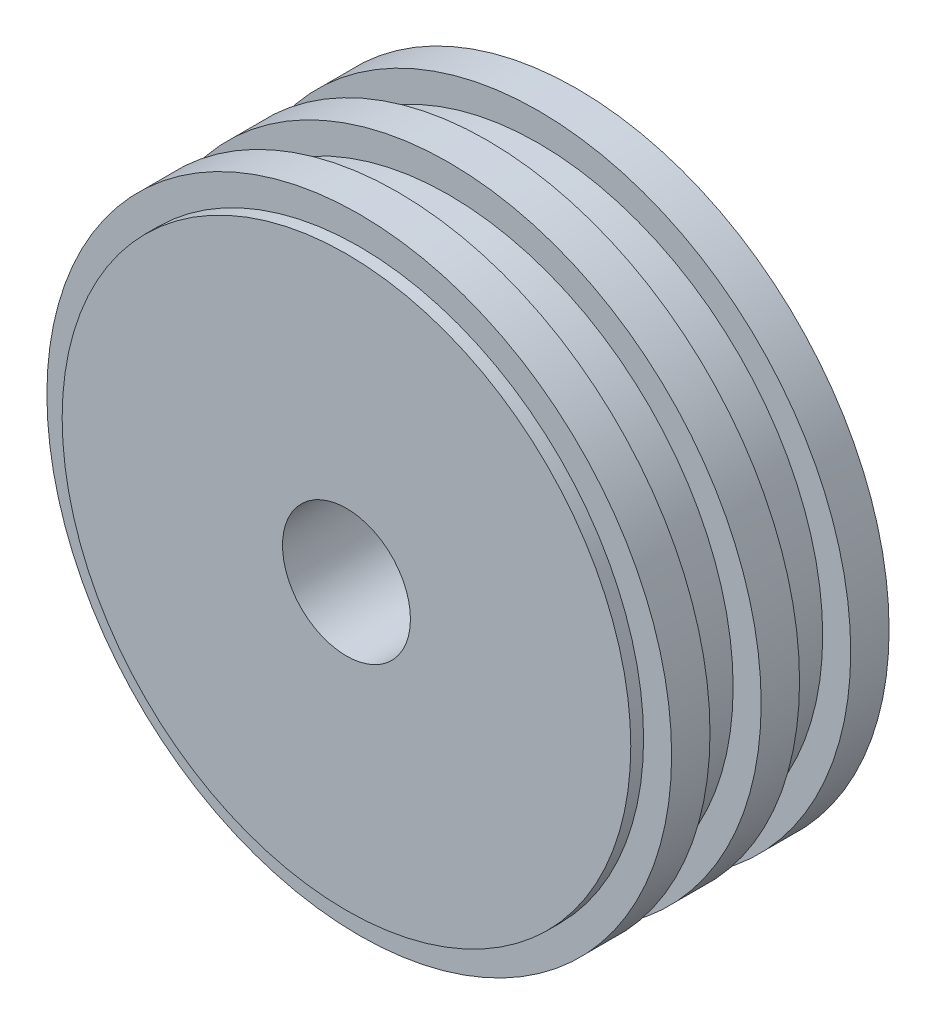
ISO-10303-21;
HEADER;
FILE_DESCRIPTION(('STEP AP214'),'2;1');
FILE_NAME('part.step','',(''),(''),'','','');
FILE_SCHEMA(('AUTOMOTIVE_DESIGN { 1 0 10303 214 1 1 1 1 }'));
ENDSEC;
DATA;
#1=APPLICATION_CONTEXT('core data for automotive mechanical design processes');
#2=APPLICATION_PROTOCOL_DEFINITION('international standard','automotive_design',2000,#1);
#3=PRODUCT_CONTEXT('',#1,'mechanical');
#4=PRODUCT('Part','Part','',(#3));
#5=PRODUCT_RELATED_PRODUCT_CATEGORY('part','',(#4));
#6=PRODUCT_DEFINITION_FORMATION('','',#4);
#7=PRODUCT_DEFINITION_CONTEXT('part definition',#1,'design');
#8=PRODUCT_DEFINITION('design','',#6,#7);
#9=PRODUCT_DEFINITION_SHAPE('','',#8);
#10=(LENGTH_UNIT() NAMED_UNIT(*) SI_UNIT(.MILLI.,.METRE.));
#11=(NAMED_UNIT(*) PLANE_ANGLE_UNIT() SI_UNIT($,.RADIAN.));
#12=(NAMED_UNIT(*) SI_UNIT($,.STERADIAN.) SOLID_ANGLE_UNIT());
#13=UNCERTAINTY_MEASURE_WITH_UNIT(LENGTH_MEASURE(1.E-05),#10,'distance_accuracy_value','');
#14=(GEOMETRIC_REPRESENTATION_CONTEXT(3) GLOBAL_UNCERTAINTY_ASSIGNED_CONTEXT((#13)) GLOBAL_UNIT_ASSIGNED_CONTEXT((#10,
#11,#12)) REPRESENTATION_CONTEXT('',''));
#15=CARTESIAN_POINT('',(0.,0.,0.));
#16=DIRECTION('',(0.,0.,1.));
#17=DIRECTION('',(1.,0.,0.));
#18=AXIS2_PLACEMENT_3D('',#15,#16,#17);
#19=CARTESIAN_POINT('',(0.,0.,-57.));
#20=DIRECTION('',(0.,0.,1.));
#21=DIRECTION('',(1.,0.,0.));
#22=AXIS2_PLACEMENT_3D('',#19,#20,#21);
#23=CYLINDRICAL_SURFACE('',#22,66.675);
#24=CARTESIAN_POINT('',(0.,0.,-57.));
#25=DIRECTION('',(0.,0.,1.));
#26=DIRECTION('',(1.,0.,0.));
#27=AXIS2_PLACEMENT_3D('',#24,#25,#26);
#28=CIRCLE('',#27,66.675);
#29=CARTESIAN_POINT('',(66.675,0.,-57.));
#30=VERTEX_POINT('',#29);
#31=EDGE_CURVE('E59',#30,#30,#28,.T.);
#32=ORIENTED_EDGE('',*,*,#31,.T.);
#33=EDGE_LOOP('',(#32));
#34=FACE_BOUND('',#33,.T.);
#35=CARTESIAN_POINT('',(0.,0.,-54.));
#36=DIRECTION('',(0.,0.,1.));
#37=DIRECTION('',(1.,0.,0.));
#38=AXIS2_PLACEMENT_3D('',#35,#36,#37);
#39=CIRCLE('',#38,66.675);
#40=CARTESIAN_POINT('',(66.675,0.,-54.));
#41=VERTEX_POINT('',#40);
#42=EDGE_CURVE('E106',#41,#41,#39,.T.);
#43=ORIENTED_EDGE('',*,*,#42,.F.);
#44=EDGE_LOOP('',(#43));
#45=FACE_BOUND('',#44,.T.);
#46=ADVANCED_FACE('F41',(#34,#45),#23,.T.);
#47=CARTESIAN_POINT('',(0.,0.,-45.));
#48=DIRECTION('',(0.,0.,1.));
#49=DIRECTION('',(1.,0.,0.));
#50=AXIS2_PLACEMENT_3D('',#47,#48,#49);
#51=CIRCLE('',#50,66.675);
#52=CARTESIAN_POINT('',(66.675,0.,-45.));
#53=VERTEX_POINT('',#52);
#54=EDGE_CURVE('E10',#53,#53,#51,.F.);
#55=ORIENTED_EDGE('',*,*,#54,.F.);
#56=EDGE_LOOP('',(#55));
#57=FACE_BOUND('',#56,.T.);
#58=CARTESIAN_POINT('',(0.,0.,-33.));
#59=DIRECTION('',(0.,0.,1.));
#60=DIRECTION('',(1.,0.,0.));
#61=AXIS2_PLACEMENT_3D('',#58,#59,#60);
#62=CIRCLE('',#61,66.675);
#63=CARTESIAN_POINT('',(66.675,0.,-33.));
#64=VERTEX_POINT('',#63);
#65=EDGE_CURVE('E94',#64,#64,#62,.T.);
#66=ORIENTED_EDGE('',*,*,#65,.F.);
#67=EDGE_LOOP('',(#66));
#68=FACE_BOUND('',#67,.T.);
#69=ADVANCED_FACE('F118',(#57,#68),#23,.T.);
#70=CARTESIAN_POINT('',(0.,0.,-24.));
#71=DIRECTION('',(0.,0.,1.));
#72=DIRECTION('',(1.,0.,0.));
#73=AXIS2_PLACEMENT_3D('',#70,#71,#72);
#74=CIRCLE('',#73,66.675);
#75=CARTESIAN_POINT('',(66.675,0.,-24.));
#76=VERTEX_POINT('',#75);
#77=EDGE_CURVE('E49',#76,#76,#74,.F.);
#78=ORIENTED_EDGE('',*,*,#77,.F.);
#79=EDGE_LOOP('',(#78));
#80=FACE_BOUND('',#79,.T.);
#81=CARTESIAN_POINT('',(0.,0.,-12.));
#82=DIRECTION('',(0.,0.,1.));
#83=DIRECTION('',(1.,0.,0.));
#84=AXIS2_PLACEMENT_3D('',#81,#82,#83);
#85=CIRCLE('',#84,66.675);
#86=CARTESIAN_POINT('',(66.675,0.,-12.));
#87=VERTEX_POINT('',#86);
#88=EDGE_CURVE('E82',#87,#87,#85,.T.);
#89=ORIENTED_EDGE('',*,*,#88,.F.);
#90=EDGE_LOOP('',(#89));
#91=FACE_BOUND('',#90,.T.);
#92=ADVANCED_FACE('F123',(#80,#91),#23,.T.);
#93=CARTESIAN_POINT('',(0.,0.,-3.));
#94=DIRECTION('',(0.,0.,1.));
#95=DIRECTION('',(1.,0.,0.));
#96=AXIS2_PLACEMENT_3D('',#93,#94,#95);
#97=CIRCLE('',#96,66.675);
#98=CARTESIAN_POINT('',(66.675,0.,-3.));
#99=VERTEX_POINT('',#98);
#100=EDGE_CURVE('E54',#99,#99,#97,.F.);
#101=ORIENTED_EDGE('',*,*,#100,.F.);
#102=EDGE_LOOP('',(#101));
#103=FACE_BOUND('',#102,.T.);
#104=CARTESIAN_POINT('',(0.,0.,0.));
#105=DIRECTION('',(0.,0.,1.));
#106=DIRECTION('',(1.,0.,0.));
#107=AXIS2_PLACEMENT_3D('',#104,#105,#106);
#108=CIRCLE('',#107,66.675);
#109=CARTESIAN_POINT('',(66.675,0.,0.));
#110=VERTEX_POINT('',#109);
#111=EDGE_CURVE('E62',#110,#110,#108,.T.);
#112=ORIENTED_EDGE('',*,*,#111,.F.);
#113=EDGE_LOOP('',(#112));
#114=FACE_BOUND('',#113,.T.);
#115=ADVANCED_FACE('F43',(#103,#114),#23,.T.);
#116=CARTESIAN_POINT('',(0.,0.,-57.));
#117=DIRECTION('',(0.,0.,1.));
#118=DIRECTION('',(1.,0.,0.));
#119=AXIS2_PLACEMENT_3D('',#116,#117,#118);
#120=PLANE('',#119);
#121=CARTESIAN_POINT('',(0.,0.,-57.));
#122=DIRECTION('',(0.,0.,1.));
#123=DIRECTION('',(1.,0.,0.));
#124=AXIS2_PLACEMENT_3D('',#121,#122,#123);
#125=CIRCLE('',#124,15.);
#126=CARTESIAN_POINT('',(15.,0.,-57.));
#127=VERTEX_POINT('',#126);
#128=EDGE_CURVE('E66',#127,#127,#125,.T.);
#129=ORIENTED_EDGE('',*,*,#128,.T.);
#130=EDGE_LOOP('',(#129));
#131=FACE_BOUND('',#130,.T.);
#132=ORIENTED_EDGE('',*,*,#31,.F.);
#133=EDGE_LOOP('',(#132));
#134=FACE_BOUND('',#133,.T.);
#135=ADVANCED_FACE('F126',(#131,#134),#120,.F.);
#136=CARTESIAN_POINT('',(0.,0.,0.));
#137=DIRECTION('',(0.,0.,1.));
#138=DIRECTION('',(1.,0.,0.));
#139=AXIS2_PLACEMENT_3D('',#136,#137,#138);
#140=PLANE('',#139);
#141=CARTESIAN_POINT('',(0.,0.,0.));
#142=DIRECTION('',(0.,0.,1.));
#143=DIRECTION('',(1.,0.,0.));
#144=AXIS2_PLACEMENT_3D('',#141,#142,#143);
#145=CIRCLE('',#144,15.);
#146=CARTESIAN_POINT('',(15.,0.,0.));
#147=VERTEX_POINT('',#146);
#148=EDGE_CURVE('E70',#147,#147,#145,.T.);
#149=ORIENTED_EDGE('',*,*,#148,.F.);
#150=EDGE_LOOP('',(#149));
#151=FACE_BOUND('',#150,.T.);
#152=ORIENTED_EDGE('',*,*,#111,.T.);
#153=EDGE_LOOP('',(#152));
#154=FACE_BOUND('',#153,.T.);
#155=ADVANCED_FACE('F132',(#151,#154),#140,.T.);
#156=CARTESIAN_POINT('',(0.,0.,-57.));
#157=DIRECTION('',(0.,0.,1.));
#158=DIRECTION('',(1.,0.,0.));
#159=AXIS2_PLACEMENT_3D('',#156,#157,#158);
#160=CYLINDRICAL_SURFACE('',#159,15.);
#161=ORIENTED_EDGE('',*,*,#128,.F.);
#162=EDGE_LOOP('',(#161));
#163=FACE_BOUND('',#162,.T.);
#164=ORIENTED_EDGE('',*,*,#148,.T.);
#165=EDGE_LOOP('',(#164));
#166=FACE_BOUND('',#165,.T.);
#167=ADVANCED_FACE('F141',(#163,#166),#160,.F.);
#168=CARTESIAN_POINT('',(0.,0.,-12.));
#169=DIRECTION('',(0.,0.,1.));
#170=DIRECTION('',(1.,0.,0.));
#171=AXIS2_PLACEMENT_3D('',#168,#169,#170);
#172=CYLINDRICAL_SURFACE('',#171,73.25);
#173=CARTESIAN_POINT('',(0.,0.,-12.));
#174=DIRECTION('',(0.,0.,1.));
#175=DIRECTION('',(1.,0.,0.));
#176=AXIS2_PLACEMENT_3D('',#173,#174,#175);
#177=CIRCLE('',#176,73.25);
#178=CARTESIAN_POINT('',(73.25,0.,-12.));
#179=VERTEX_POINT('',#178);
#180=EDGE_CURVE('E74',#179,#179,#177,.T.);
#181=ORIENTED_EDGE('',*,*,#180,.T.);
#182=EDGE_LOOP('',(#181));
#183=FACE_BOUND('',#182,.T.);
#184=CARTESIAN_POINT('',(0.,0.,-3.));
#185=DIRECTION('',(0.,0.,1.));
#186=DIRECTION('',(1.,0.,0.));
#187=AXIS2_PLACEMENT_3D('',#184,#185,#186);
#188=CIRCLE('',#187,73.25);
#189=CARTESIAN_POINT('',(73.25,0.,-3.));
#190=VERTEX_POINT('',#189);
#191=EDGE_CURVE('E78',#190,#190,#188,.T.);
#192=ORIENTED_EDGE('',*,*,#191,.F.);
#193=EDGE_LOOP('',(#192));
#194=FACE_BOUND('',#193,.T.);
#195=ADVANCED_FACE('F146',(#183,#194),#172,.T.);
#196=CARTESIAN_POINT('',(0.,0.,-12.));
#197=DIRECTION('',(0.,0.,1.));
#198=DIRECTION('',(1.,0.,0.));
#199=AXIS2_PLACEMENT_3D('',#196,#197,#198);
#200=PLANE('',#199);
#201=ORIENTED_EDGE('',*,*,#88,.T.);
#202=EDGE_LOOP('',(#201));
#203=FACE_BOUND('',#202,.T.);
#204=ORIENTED_EDGE('',*,*,#180,.F.);
#205=EDGE_LOOP('',(#204));
#206=FACE_BOUND('',#205,.T.);
#207=ADVANCED_FACE('F153',(#203,#206),#200,.F.);
#208=CARTESIAN_POINT('',(0.,0.,-3.));
#209=DIRECTION('',(0.,0.,1.));
#210=DIRECTION('',(1.,0.,0.));
#211=AXIS2_PLACEMENT_3D('',#208,#209,#210);
#212=PLANE('',#211);
#213=ORIENTED_EDGE('',*,*,#100,.T.);
#214=EDGE_LOOP('',(#213));
#215=FACE_BOUND('',#214,.T.);
#216=ORIENTED_EDGE('',*,*,#191,.T.);
#217=EDGE_LOOP('',(#216));
#218=FACE_BOUND('',#217,.T.);
#219=ADVANCED_FACE('F155',(#215,#218),#212,.T.);
#220=CARTESIAN_POINT('',(0.,0.,-33.));
#221=DIRECTION('',(0.,0.,1.));
#222=DIRECTION('',(1.,0.,0.));
#223=AXIS2_PLACEMENT_3D('',#220,#221,#222);
#224=CYLINDRICAL_SURFACE('',#223,73.25);
#225=CARTESIAN_POINT('',(0.,0.,-33.));
#226=DIRECTION('',(0.,0.,1.));
#227=DIRECTION('',(1.,0.,0.));
#228=AXIS2_PLACEMENT_3D('',#225,#226,#227);
#229=CIRCLE('',#228,73.25);
#230=CARTESIAN_POINT('',(73.25,0.,-33.));
#231=VERTEX_POINT('',#230);
#232=EDGE_CURVE('E89',#231,#231,#229,.T.);
#233=ORIENTED_EDGE('',*,*,#232,.T.);
#234=EDGE_LOOP('',(#233));
#235=FACE_BOUND('',#234,.T.);
#236=CARTESIAN_POINT('',(0.,0.,-24.));
#237=DIRECTION('',(0.,0.,1.));
#238=DIRECTION('',(1.,0.,0.));
#239=AXIS2_PLACEMENT_3D('',#236,#237,#238);
#240=CIRCLE('',#239,73.25);
#241=CARTESIAN_POINT('',(73.25,0.,-24.));
#242=VERTEX_POINT('',#241);
#243=EDGE_CURVE('E90',#242,#242,#240,.T.);
#244=ORIENTED_EDGE('',*,*,#243,.F.);
#245=EDGE_LOOP('',(#244));
#246=FACE_BOUND('',#245,.T.);
#247=ADVANCED_FACE('F158',(#235,#246),#224,.T.);
#248=CARTESIAN_POINT('',(0.,0.,-33.));
#249=DIRECTION('',(0.,0.,1.));
#250=DIRECTION('',(1.,0.,0.));
#251=AXIS2_PLACEMENT_3D('',#248,#249,#250);
#252=PLANE('',#251);
#253=ORIENTED_EDGE('',*,*,#65,.T.);
#254=EDGE_LOOP('',(#253));
#255=FACE_BOUND('',#254,.T.);
#256=ORIENTED_EDGE('',*,*,#232,.F.);
#257=EDGE_LOOP('',(#256));
#258=FACE_BOUND('',#257,.T.);
#259=ADVANCED_FACE('F165',(#255,#258),#252,.F.);
#260=CARTESIAN_POINT('',(0.,0.,-24.));
#261=DIRECTION('',(0.,0.,1.));
#262=DIRECTION('',(1.,0.,0.));
#263=AXIS2_PLACEMENT_3D('',#260,#261,#262);
#264=PLANE('',#263);
#265=ORIENTED_EDGE('',*,*,#77,.T.);
#266=EDGE_LOOP('',(#265));
#267=FACE_BOUND('',#266,.T.);
#268=ORIENTED_EDGE('',*,*,#243,.T.);
#269=EDGE_LOOP('',(#268));
#270=FACE_BOUND('',#269,.T.);
#271=ADVANCED_FACE('F167',(#267,#270),#264,.T.);
#272=CARTESIAN_POINT('',(0.,0.,-54.));
#273=DIRECTION('',(0.,0.,1.));
#274=DIRECTION('',(1.,0.,0.));
#275=AXIS2_PLACEMENT_3D('',#272,#273,#274);
#276=CYLINDRICAL_SURFACE('',#275,73.25);
#277=CARTESIAN_POINT('',(0.,0.,-54.));
#278=DIRECTION('',(0.,0.,1.));
#279=DIRECTION('',(1.,0.,0.));
#280=AXIS2_PLACEMENT_3D('',#277,#278,#279);
#281=CIRCLE('',#280,73.25);
#282=CARTESIAN_POINT('',(73.25,0.,-54.));
#283=VERTEX_POINT('',#282);
#284=EDGE_CURVE('E101',#283,#283,#281,.T.);
#285=ORIENTED_EDGE('',*,*,#284,.T.);
#286=EDGE_LOOP('',(#285));
#287=FACE_BOUND('',#286,.T.);
#288=CARTESIAN_POINT('',(0.,0.,-45.));
#289=DIRECTION('',(0.,0.,1.));
#290=DIRECTION('',(1.,0.,0.));
#291=AXIS2_PLACEMENT_3D('',#288,#289,#290);
#292=CIRCLE('',#291,73.25);
#293=CARTESIAN_POINT('',(73.25,0.,-45.));
#294=VERTEX_POINT('',#293);
#295=EDGE_CURVE('E102',#294,#294,#292,.T.);
#296=ORIENTED_EDGE('',*,*,#295,.F.);
#297=EDGE_LOOP('',(#296));
#298=FACE_BOUND('',#297,.T.);
#299=ADVANCED_FACE('F170',(#287,#298),#276,.T.);
#300=CARTESIAN_POINT('',(0.,0.,-54.));
#301=DIRECTION('',(0.,0.,1.));
#302=DIRECTION('',(1.,0.,0.));
#303=AXIS2_PLACEMENT_3D('',#300,#301,#302);
#304=PLANE('',#303);
#305=ORIENTED_EDGE('',*,*,#42,.T.);
#306=EDGE_LOOP('',(#305));
#307=FACE_BOUND('',#306,.T.);
#308=ORIENTED_EDGE('',*,*,#284,.F.);
#309=EDGE_LOOP('',(#308));
#310=FACE_BOUND('',#309,.T.);
#311=ADVANCED_FACE('F114',(#307,#310),#304,.F.);
#312=CARTESIAN_POINT('',(0.,0.,-45.));
#313=DIRECTION('',(0.,0.,1.));
#314=DIRECTION('',(1.,0.,0.));
#315=AXIS2_PLACEMENT_3D('',#312,#313,#314);
#316=PLANE('',#315);
#317=ORIENTED_EDGE('',*,*,#54,.T.);
#318=EDGE_LOOP('',(#317));
#319=FACE_BOUND('',#318,.T.);
#320=ORIENTED_EDGE('',*,*,#295,.T.);
#321=EDGE_LOOP('',(#320));
#322=FACE_BOUND('',#321,.T.);
#323=ADVANCED_FACE('F177',(#319,#322),#316,.T.);
#324=CLOSED_SHELL('',(#46,#69,#92,#115,#135,#155,#167,#195,#207,#219,#247,#259,#271,#299,#311,#323));
#325=MANIFOLD_SOLID_BREP('B2',#324);
#326=ADVANCED_BREP_SHAPE_REPRESENTATION('',(#18,#325),#14);
#327=SHAPE_DEFINITION_REPRESENTATION(#9,#326);
ENDSEC;
END-ISO-10303-21;
